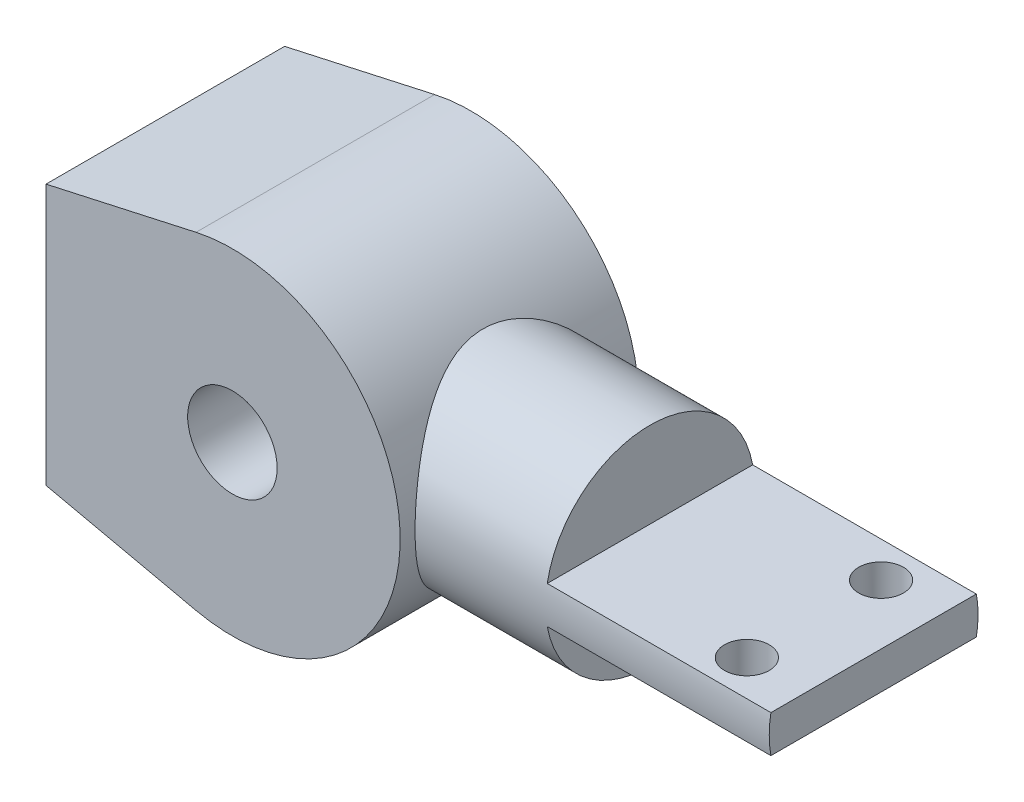
ISO-10303-21;
HEADER;
FILE_DESCRIPTION(('STEP AP214'),'2;1');
FILE_NAME('part.step','',(''),(''),'','','');
FILE_SCHEMA(('AUTOMOTIVE_DESIGN { 1 0 10303 214 1 1 1 1 }'));
ENDSEC;
DATA;
#1=APPLICATION_CONTEXT('core data for automotive mechanical design processes');
#2=APPLICATION_PROTOCOL_DEFINITION('international standard','automotive_design',2000,#1);
#3=PRODUCT_CONTEXT('',#1,'mechanical');
#4=PRODUCT('Part','Part','',(#3));
#5=PRODUCT_RELATED_PRODUCT_CATEGORY('part','',(#4));
#6=PRODUCT_DEFINITION_FORMATION('','',#4);
#7=PRODUCT_DEFINITION_CONTEXT('part definition',#1,'design');
#8=PRODUCT_DEFINITION('design','',#6,#7);
#9=PRODUCT_DEFINITION_SHAPE('','',#8);
#10=(LENGTH_UNIT() NAMED_UNIT(*) SI_UNIT(.MILLI.,.METRE.));
#11=(NAMED_UNIT(*) PLANE_ANGLE_UNIT() SI_UNIT($,.RADIAN.));
#12=(NAMED_UNIT(*) SI_UNIT($,.STERADIAN.) SOLID_ANGLE_UNIT());
#13=UNCERTAINTY_MEASURE_WITH_UNIT(LENGTH_MEASURE(1.E-05),#10,'distance_accuracy_value','');
#14=(GEOMETRIC_REPRESENTATION_CONTEXT(3) GLOBAL_UNCERTAINTY_ASSIGNED_CONTEXT((#13)) GLOBAL_UNIT_ASSIGNED_CONTEXT((#10,
#11,#12)) REPRESENTATION_CONTEXT('',''));
#15=CARTESIAN_POINT('',(0.,0.,0.));
#16=DIRECTION('',(0.,0.,1.));
#17=DIRECTION('',(1.,0.,0.));
#18=AXIS2_PLACEMENT_3D('',#15,#16,#17);
#19=CARTESIAN_POINT('',(40.,0.,0.));
#20=DIRECTION('',(1.,0.,0.));
#21=DIRECTION('',(0.,0.,-1.));
#22=AXIS2_PLACEMENT_3D('',#19,#20,#21);
#23=PLANE('',#22);
#24=CARTESIAN_POINT('',(40.,0.,0.));
#25=DIRECTION('',(1.,0.,0.));
#26=DIRECTION('',(0.,0.,-1.));
#27=AXIS2_PLACEMENT_3D('',#24,#25,#26);
#28=CIRCLE('',#27,14.);
#29=CARTESIAN_POINT('',(40.,2.5,-13.7749773139559));
#30=VERTEX_POINT('',#29);
#31=CARTESIAN_POINT('',(40.,2.5,13.7749773139559));
#32=VERTEX_POINT('',#31);
#33=EDGE_CURVE('E59',#30,#32,#28,.T.);
#34=ORIENTED_EDGE('',*,*,#33,.T.);
#35=DIRECTION('',(0.,0.,-1.));
#36=VECTOR('',#35,1.);
#37=CARTESIAN_POINT('',(40.,2.5,0.));
#38=LINE('',#37,#36);
#39=EDGE_CURVE('E109',#32,#30,#38,.T.);
#40=ORIENTED_EDGE('',*,*,#39,.T.);
#41=EDGE_LOOP('',(#34,#40));
#42=FACE_BOUND('',#41,.T.);
#43=ADVANCED_FACE('F36',(#42),#23,.T.);
#44=CARTESIAN_POINT('',(0.,0.,16.));
#45=DIRECTION('',(0.,0.,1.));
#46=DIRECTION('',(1.,0.,0.));
#47=AXIS2_PLACEMENT_3D('',#44,#45,#46);
#48=PLANE('',#47);
#49=DIRECTION('',(-0.976255788673511,-0.216620947928542,0.));
#50=VECTOR('',#49,1.);
#51=CARTESIAN_POINT('',(-4.87397132839219,21.965755245154,16.));
#52=LINE('',#51,#50);
#53=CARTESIAN_POINT('',(-4.87397132839219,21.965755245154,16.));
#54=VERTEX_POINT('',#53);
#55=CARTESIAN_POINT('',(-25.,17.5,16.));
#56=VERTEX_POINT('',#55);
#57=EDGE_CURVE('E199',#54,#56,#52,.T.);
#58=ORIENTED_EDGE('',*,*,#57,.T.);
#59=DIRECTION('',(0.,-1.,0.));
#60=VECTOR('',#59,1.);
#61=CARTESIAN_POINT('',(-25.,17.5,16.));
#62=LINE('',#61,#60);
#63=CARTESIAN_POINT('',(-25.,-17.5,16.));
#64=VERTEX_POINT('',#63);
#65=EDGE_CURVE('E211',#56,#64,#62,.T.);
#66=ORIENTED_EDGE('',*,*,#65,.T.);
#67=DIRECTION('',(0.976255788673511,-0.216620947928542,0.));
#68=VECTOR('',#67,1.);
#69=CARTESIAN_POINT('',(-4.87397132839219,-21.965755245154,16.));
#70=LINE('',#69,#68);
#71=CARTESIAN_POINT('',(-4.87397132839219,-21.965755245154,16.));
#72=VERTEX_POINT('',#71);
#73=EDGE_CURVE('E209',#64,#72,#70,.T.);
#74=ORIENTED_EDGE('',*,*,#73,.T.);
#75=CARTESIAN_POINT('',(0.,0.,16.));
#76=DIRECTION('',(0.,0.,1.));
#77=DIRECTION('',(1.,0.,0.));
#78=AXIS2_PLACEMENT_3D('',#75,#76,#77);
#79=CIRCLE('',#78,22.5);
#80=EDGE_CURVE('E196',#72,#54,#79,.T.);
#81=ORIENTED_EDGE('',*,*,#80,.T.);
#82=EDGE_LOOP('',(#58,#66,#74,#81));
#83=FACE_BOUND('',#82,.T.);
#84=CARTESIAN_POINT('',(0.,0.,16.));
#85=DIRECTION('',(0.,0.,1.));
#86=DIRECTION('',(1.,0.,0.));
#87=AXIS2_PLACEMENT_3D('',#84,#85,#86);
#88=CIRCLE('',#87,6.);
#89=CARTESIAN_POINT('',(6.,0.,16.));
#90=VERTEX_POINT('',#89);
#91=EDGE_CURVE('E207',#90,#90,#88,.T.);
#92=ORIENTED_EDGE('',*,*,#91,.F.);
#93=EDGE_LOOP('',(#92));
#94=FACE_BOUND('',#93,.T.);
#95=ADVANCED_FACE('F166',(#83,#94),#48,.T.);
#96=CARTESIAN_POINT('',(0.,0.,-16.));
#97=DIRECTION('',(0.,0.,1.));
#98=DIRECTION('',(1.,0.,0.));
#99=AXIS2_PLACEMENT_3D('',#96,#97,#98);
#100=PLANE('',#99);
#101=DIRECTION('',(-0.976255788673511,-0.216620947928542,0.));
#102=VECTOR('',#101,1.);
#103=CARTESIAN_POINT('',(-4.87397132839219,21.965755245154,-16.));
#104=LINE('',#103,#102);
#105=CARTESIAN_POINT('',(-4.87397132839219,21.965755245154,-16.));
#106=VERTEX_POINT('',#105);
#107=CARTESIAN_POINT('',(-25.,17.5,-16.));
#108=VERTEX_POINT('',#107);
#109=EDGE_CURVE('E204',#106,#108,#104,.T.);
#110=ORIENTED_EDGE('',*,*,#109,.F.);
#111=CARTESIAN_POINT('',(0.,0.,-16.));
#112=DIRECTION('',(0.,0.,1.));
#113=DIRECTION('',(1.,0.,0.));
#114=AXIS2_PLACEMENT_3D('',#111,#112,#113);
#115=CIRCLE('',#114,22.5);
#116=CARTESIAN_POINT('',(-4.87397132839219,-21.965755245154,-16.));
#117=VERTEX_POINT('',#116);
#118=EDGE_CURVE('E197',#117,#106,#115,.T.);
#119=ORIENTED_EDGE('',*,*,#118,.F.);
#120=DIRECTION('',(0.976255788673511,-0.216620947928542,0.));
#121=VECTOR('',#120,1.);
#122=CARTESIAN_POINT('',(-4.87397132839219,-21.965755245154,-16.));
#123=LINE('',#122,#121);
#124=CARTESIAN_POINT('',(-25.,-17.5,-16.));
#125=VERTEX_POINT('',#124);
#126=EDGE_CURVE('E200',#125,#117,#123,.T.);
#127=ORIENTED_EDGE('',*,*,#126,.F.);
#128=DIRECTION('',(0.,-1.,0.));
#129=VECTOR('',#128,1.);
#130=CARTESIAN_POINT('',(-25.,17.5,-16.));
#131=LINE('',#130,#129);
#132=EDGE_CURVE('E202',#108,#125,#131,.T.);
#133=ORIENTED_EDGE('',*,*,#132,.F.);
#134=EDGE_LOOP('',(#110,#119,#127,#133));
#135=FACE_BOUND('',#134,.T.);
#136=CARTESIAN_POINT('',(0.,0.,-16.));
#137=DIRECTION('',(0.,0.,1.));
#138=DIRECTION('',(1.,0.,0.));
#139=AXIS2_PLACEMENT_3D('',#136,#137,#138);
#140=CIRCLE('',#139,6.);
#141=CARTESIAN_POINT('',(6.,0.,-16.));
#142=VERTEX_POINT('',#141);
#143=EDGE_CURVE('E215',#142,#142,#140,.T.);
#144=ORIENTED_EDGE('',*,*,#143,.T.);
#145=EDGE_LOOP('',(#144));
#146=FACE_BOUND('',#145,.T.);
#147=ADVANCED_FACE('F222',(#135,#146),#100,.F.);
#148=CARTESIAN_POINT('',(-4.87397132839219,21.965755245154,16.));
#149=DIRECTION('',(0.216620947928542,-0.976255788673511,0.));
#150=DIRECTION('',(0.976255788673512,0.216620947928542,0.));
#151=AXIS2_PLACEMENT_3D('',#148,#149,#150);
#152=PLANE('',#151);
#153=ORIENTED_EDGE('',*,*,#109,.T.);
#154=DIRECTION('',(0.,0.,-1.));
#155=VECTOR('',#154,1.);
#156=CARTESIAN_POINT('',(-25.,17.5,16.));
#157=LINE('',#156,#155);
#158=EDGE_CURVE('E11',#56,#108,#157,.T.);
#159=ORIENTED_EDGE('',*,*,#158,.F.);
#160=ORIENTED_EDGE('',*,*,#57,.F.);
#161=DIRECTION('',(0.,0.,-1.));
#162=VECTOR('',#161,1.);
#163=CARTESIAN_POINT('',(-4.87397132839219,21.965755245154,16.));
#164=LINE('',#163,#162);
#165=EDGE_CURVE('E193',#54,#106,#164,.T.);
#166=ORIENTED_EDGE('',*,*,#165,.T.);
#167=EDGE_LOOP('',(#153,#159,#160,#166));
#168=FACE_BOUND('',#167,.T.);
#169=ADVANCED_FACE('F38',(#168),#152,.F.);
#170=CARTESIAN_POINT('',(-25.,17.5,16.));
#171=DIRECTION('',(1.,0.,0.));
#172=DIRECTION('',(0.,0.,-1.));
#173=AXIS2_PLACEMENT_3D('',#170,#171,#172);
#174=PLANE('',#173);
#175=ORIENTED_EDGE('',*,*,#132,.T.);
#176=DIRECTION('',(0.,0.,-1.));
#177=VECTOR('',#176,1.);
#178=CARTESIAN_POINT('',(-25.,-17.5,16.));
#179=LINE('',#178,#177);
#180=EDGE_CURVE('E45',#64,#125,#179,.T.);
#181=ORIENTED_EDGE('',*,*,#180,.F.);
#182=ORIENTED_EDGE('',*,*,#65,.F.);
#183=ORIENTED_EDGE('',*,*,#158,.T.);
#184=EDGE_LOOP('',(#175,#181,#182,#183));
#185=FACE_BOUND('',#184,.T.);
#186=ADVANCED_FACE('F236',(#185),#174,.F.);
#187=CARTESIAN_POINT('',(-4.87397132839219,-21.965755245154,16.));
#188=DIRECTION('',(0.216620947928542,0.976255788673511,0.));
#189=DIRECTION('',(-0.976255788673512,0.216620947928542,0.));
#190=AXIS2_PLACEMENT_3D('',#187,#188,#189);
#191=PLANE('',#190);
#192=ORIENTED_EDGE('',*,*,#126,.T.);
#193=DIRECTION('',(0.,0.,-1.));
#194=VECTOR('',#193,1.);
#195=CARTESIAN_POINT('',(-4.87397132839219,-21.965755245154,16.));
#196=LINE('',#195,#194);
#197=EDGE_CURVE('E190',#72,#117,#196,.T.);
#198=ORIENTED_EDGE('',*,*,#197,.F.);
#199=ORIENTED_EDGE('',*,*,#73,.F.);
#200=ORIENTED_EDGE('',*,*,#180,.T.);
#201=EDGE_LOOP('',(#192,#198,#199,#200));
#202=FACE_BOUND('',#201,.T.);
#203=ADVANCED_FACE('F233',(#202),#191,.F.);
#204=CARTESIAN_POINT('',(0.,0.,16.));
#205=DIRECTION('',(0.,0.,-1.));
#206=DIRECTION('',(-1.,0.,0.));
#207=AXIS2_PLACEMENT_3D('',#204,#205,#206);
#208=CYLINDRICAL_SURFACE('',#207,22.5);
#209=CARTESIAN_POINT('',(22.5,0.,-14.));
#210=CARTESIAN_POINT('',(22.4999990143699,0.356097070760692,-13.9999991063449));
#211=CARTESIAN_POINT('',(22.4915272958149,0.712218350277574,-13.9863954765435));
#212=CARTESIAN_POINT('',(22.4578466611244,1.42174063001493,-13.9321685824194));
#213=CARTESIAN_POINT('',(22.4326301887648,1.77514032923202,-13.8915331197188));
#214=CARTESIAN_POINT('',(22.3660283513862,2.47694073666972,-13.7837231030717));
#215=CARTESIAN_POINT('',(22.3246150990087,2.82533174256533,-13.7165027734724));
#216=CARTESIAN_POINT('',(22.2266321618331,3.51394010054276,-13.5564441244614));
#217=CARTESIAN_POINT('',(22.1700640019058,3.85415827121584,-13.4636083824175));
#218=CARTESIAN_POINT('',(22.0433958764243,4.52259338441289,-13.2539894629711));
#219=CARTESIAN_POINT('',(21.9733648543906,4.85086174847135,-13.1373281147551));
#220=CARTESIAN_POINT('',(21.8211053520407,5.49536361825577,-12.8810427155204));
#221=CARTESIAN_POINT('',(21.7388766091287,5.81159686470234,-12.7414181701369));
#222=CARTESIAN_POINT('',(21.5639238631528,6.43044019166893,-12.4405700102356));
#223=CARTESIAN_POINT('',(21.4712031207009,6.73305446393551,-12.2793531031596));
#224=CARTESIAN_POINT('',(21.2770168328875,7.32360555209682,-11.9365571460911));
#225=CARTESIAN_POINT('',(21.1755502028841,7.61154054043849,-11.7549755696832));
#226=CARTESIAN_POINT('',(20.9573974599138,8.19400545558421,-11.3574765199916));
#227=CARTESIAN_POINT('',(20.8401426208988,8.48724295592486,-11.1399774171205));
#228=CARTESIAN_POINT('',(20.600024873324,9.05449350465571,-10.6840341744649));
#229=CARTESIAN_POINT('',(20.4771617165154,9.32850570068461,-10.445589107087));
#230=CARTESIAN_POINT('',(20.2281690739126,9.85680235955471,-9.94862465188904));
#231=CARTESIAN_POINT('',(20.1020356451637,10.111061375416,-9.69008020116803));
#232=CARTESIAN_POINT('',(19.8492724340888,10.5986702200811,-9.1542032090265));
#233=CARTESIAN_POINT('',(19.722642637357,10.8320194372713,-8.87687011845291));
#234=CARTESIAN_POINT('',(19.4547996495074,11.3068419436011,-8.2658596247561));
#235=CARTESIAN_POINT('',(19.3139089577244,11.545205662179,-7.92961458355073));
#236=CARTESIAN_POINT('',(19.0393482416016,11.9925865501106,-7.23522428056693));
#237=CARTESIAN_POINT('',(18.9056795541224,12.2015982975125,-6.877074990088));
#238=CARTESIAN_POINT('',(18.6504569420656,12.5882506642244,-6.14073545483857));
#239=CARTESIAN_POINT('',(18.528886831374,12.7659334496767,-5.76257305179082));
#240=CARTESIAN_POINT('',(18.3026958276451,13.0881671689531,-4.98756561364782));
#241=CARTESIAN_POINT('',(18.1980680018518,13.2327316648236,-4.59072830652404));
#242=CARTESIAN_POINT('',(18.0349292211783,13.4538110619401,-3.88513918827319));
#243=CARTESIAN_POINT('',(17.9714792470539,13.5382643592609,-3.57999709901742));
#244=CARTESIAN_POINT('',(17.8586883245612,13.6867074831745,-2.96224320580907));
#245=CARTESIAN_POINT('',(17.8093439846518,13.7507022292345,-2.64963321704918));
#246=CARTESIAN_POINT('',(17.7265086605148,13.8573251676281,-2.01907360660311));
#247=CARTESIAN_POINT('',(17.6929994513684,13.8999779261594,-1.70113056156642));
#248=CARTESIAN_POINT('',(17.6430064881633,13.9633794501665,-1.06171502205683));
#249=CARTESIAN_POINT('',(17.6265229749471,13.9841279057882,-0.740242477721284));
#250=CARTESIAN_POINT('',(17.6112162512838,14.0034002854199,-0.0953808872242191));
#251=CARTESIAN_POINT('',(17.6124383808281,14.0018671514822,0.228010958708225));
#252=CARTESIAN_POINT('',(17.6326039054413,13.97646364726,0.873354428547934));
#253=CARTESIAN_POINT('',(17.6515473921147,13.9525931615104,1.19530604500179));
#254=CARTESIAN_POINT('',(17.7064243703099,13.8828847906998,1.83556301177622));
#255=CARTESIAN_POINT('',(17.7423695341295,13.8370318135284,2.15386570296615));
#256=CARTESIAN_POINT('',(17.8299101531281,13.7240443241488,2.78446216526763));
#257=CARTESIAN_POINT('',(17.8815059542076,13.6569093415775,3.09675580340859));
#258=CARTESIAN_POINT('',(17.9972888935506,13.5039464211317,3.70676991729286));
#259=CARTESIAN_POINT('',(18.0611741417939,13.4185620879421,4.00465984733719));
#260=CARTESIAN_POINT('',(18.2003635920619,13.2291560354186,4.59179982140109));
#261=CARTESIAN_POINT('',(18.2756715114669,13.1251282467728,4.88104701592401));
#262=CARTESIAN_POINT('',(18.4357306593898,12.8993400599701,5.44983142456797));
#263=CARTESIAN_POINT('',(18.5204822849188,12.7775789162412,5.7293682298181));
#264=CARTESIAN_POINT('',(18.6974771275311,12.517153681204,6.27798380238451));
#265=CARTESIAN_POINT('',(18.7897207095436,12.3784887663568,6.54706205932532));
#266=CARTESIAN_POINT('',(18.997481055651,12.0577227084505,7.12315036574905));
#267=CARTESIAN_POINT('',(19.114138485546,11.8723373870692,7.42792424344295));
#268=CARTESIAN_POINT('',(19.3523613239283,11.4799300062105,8.02107596986107));
#269=CARTESIAN_POINT('',(19.4739260475583,11.2729109595519,8.30945609304614));
#270=CARTESIAN_POINT('',(19.7193557781036,10.8378705685859,8.86940709190691));
#271=CARTESIAN_POINT('',(19.8432230246409,10.6098278185812,9.14096035407191));
#272=CARTESIAN_POINT('',(20.0905456910712,10.1337040929321,9.6661096951861));
#273=CARTESIAN_POINT('',(20.2140010842358,9.88562184213812,9.9197046294846));
#274=CARTESIAN_POINT('',(20.4778479284996,9.3283197696847,10.4476162402387));
#275=CARTESIAN_POINT('',(20.6177380925806,9.01571048102724,10.7186212696107));
#276=CARTESIAN_POINT('',(20.8899601598757,8.36562967979878,11.2333493529561));
#277=CARTESIAN_POINT('',(21.0222911743807,8.02815525453593,11.4770692023033));
#278=CARTESIAN_POINT('',(21.2758074096154,7.3299323932841,11.9350888320568));
#279=CARTESIAN_POINT('',(21.3969953836647,6.96918974429674,12.1493958865148));
#280=CARTESIAN_POINT('',(21.6248469618756,6.22630498724363,12.5463308451294));
#281=CARTESIAN_POINT('',(21.7315123020849,5.84416544470126,12.7289625365012));
#282=CARTESIAN_POINT('',(21.9217363589385,5.08260793859718,13.0509942907445));
#283=CARTESIAN_POINT('',(22.0062449689521,4.70420212464339,13.1922230753291));
#284=CARTESIAN_POINT('',(22.1570252528652,3.93324908027808,13.442236496525));
#285=CARTESIAN_POINT('',(22.2232972892521,3.54070213112461,13.5510217780177));
#286=CARTESIAN_POINT('',(22.3354988912287,2.74528889528994,13.7342547837559));
#287=CARTESIAN_POINT('',(22.3814519255366,2.34243508535216,13.8087421267131));
#288=CARTESIAN_POINT('',(22.4516271114232,1.52990582154782,13.9221968391314));
#289=CARTESIAN_POINT('',(22.4758528968536,1.12023152007733,13.961170148282));
#290=CARTESIAN_POINT('',(22.4998719272296,0.358889373676654,13.9997998195308));
#291=CARTESIAN_POINT('',(22.5027361711104,0.00755774378719221,14.0043982827077));
#292=CARTESIAN_POINT('',(22.4920251896601,-0.694179982355568,13.9871816996814));
#293=CARTESIAN_POINT('',(22.4784519037889,-1.04458618291156,13.9653697696335));
#294=CARTESIAN_POINT('',(22.4352021344506,-1.74175208722438,13.8956481416465));
#295=CARTESIAN_POINT('',(22.4055265956152,-2.08851200367258,13.8477399746312));
#296=CARTESIAN_POINT('',(22.3307880770863,-2.77586354777609,13.7264844114638));
#297=CARTESIAN_POINT('',(22.285724811575,-3.11645506073326,13.653136542784));
#298=CARTESIAN_POINT('',(22.1832184234865,-3.77653035917098,13.4851559526508));
#299=CARTESIAN_POINT('',(22.1263027830684,-4.09632676495062,13.3914243330754));
#300=CARTESIAN_POINT('',(22.0003545406357,-4.72626431908141,13.1822823440839));
#301=CARTESIAN_POINT('',(21.931322429587,-5.0364058580537,13.0668728530538));
#302=CARTESIAN_POINT('',(21.782472736762,-5.64554678099418,12.8154741779394));
#303=CARTESIAN_POINT('',(21.7026548278234,-5.94454582662948,12.6794843695837));
#304=CARTESIAN_POINT('',(21.5336854587996,-6.5301837746921,12.3880468486983));
#305=CARTESIAN_POINT('',(21.4445328551239,-6.81682115660849,12.2325967516374));
#306=CARTESIAN_POINT('',(21.2490077061142,-7.40508045510371,11.8866610539475));
#307=CARTESIAN_POINT('',(21.1418056549229,-7.70527800990255,11.6942214627053));
#308=CARTESIAN_POINT('',(20.9200990227065,-8.28835118714579,11.288463870177));
#309=CARTESIAN_POINT('',(20.8055940342632,-8.57122584144697,11.0751447036999));
#310=CARTESIAN_POINT('',(20.5713838782847,-9.11904546917578,10.628640705419));
#311=CARTESIAN_POINT('',(20.4516736642968,-9.38397237592854,10.3954363746239));
#312=CARTESIAN_POINT('',(20.2094563165926,-9.89483745973913,9.91041232281628));
#313=CARTESIAN_POINT('',(20.0869489675645,-10.1407741685819,9.65859116539602));
#314=CARTESIAN_POINT('',(19.8238941960109,-10.646867649964,9.09978037256264));
#315=CARTESIAN_POINT('',(19.6832841834239,-10.9039892311197,8.79006308548143));
#316=CARTESIAN_POINT('',(19.4053328807151,-11.3913021109329,8.14864949782422));
#317=CARTESIAN_POINT('',(19.2679921450446,-11.621488867149,7.81694950469237));
#318=CARTESIAN_POINT('',(19.0008081273582,-12.0533696487139,7.13300281471241));
#319=CARTESIAN_POINT('',(18.8709590653482,-12.25508581837,6.78077239104192));
#320=CARTESIAN_POINT('',(18.623036461906,-12.6286498218822,6.05666117524255));
#321=CARTESIAN_POINT('',(18.5049651721,-12.8004919491879,5.68477664643217));
#322=CARTESIAN_POINT('',(18.308524713068,-13.0793953783023,5.0034855779446));
#323=CARTESIAN_POINT('',(18.2270330766376,-13.1924763545354,4.69743443018148));
#324=CARTESIAN_POINT('',(18.076746941565,-13.3976638555018,4.07550371447287));
#325=CARTESIAN_POINT('',(18.0079448101369,-13.489782996707,3.75963018923896));
#326=CARTESIAN_POINT('',(17.8853144274028,-13.6519549960383,3.11976359885008));
#327=CARTESIAN_POINT('',(17.8314700867102,-13.7220315751265,2.79577966995472));
#328=CARTESIAN_POINT('',(17.7406403655119,-13.8392629880396,2.14132899837133));
#329=CARTESIAN_POINT('',(17.7036549489399,-13.8864178709009,1.8108622695535));
#330=CARTESIAN_POINT('',(17.6478825891211,-13.9572312071607,1.14399970642003));
#331=CARTESIAN_POINT('',(17.6291980840485,-13.9807574190091,0.807581108722389));
#332=CARTESIAN_POINT('',(17.6111969753959,-14.0034266162649,0.133399167373299));
#333=CARTESIAN_POINT('',(17.6118803050355,-14.0025696857454,-0.204364171637467));
#334=CARTESIAN_POINT('',(17.6325872637024,-13.9764850836819,-0.878453554406331));
#335=CARTESIAN_POINT('',(17.6526172788984,-13.9512493649163,-1.21477908673595));
#336=CARTESIAN_POINT('',(17.7111635018145,-13.8768481077348,-1.88312198541007));
#337=CARTESIAN_POINT('',(17.749679494092,-13.8276828482026,-2.21513940191667));
#338=CARTESIAN_POINT('',(17.840004620949,-13.7109159899639,-2.84709643093499));
#339=CARTESIAN_POINT('',(17.8905606177838,-13.6450271196387,-3.14753630822844));
#340=CARTESIAN_POINT('',(18.0044960451393,-13.4943337274358,-3.74122938906233));
#341=CARTESIAN_POINT('',(18.0678795853599,-13.4095231425079,-4.03448025553805));
#342=CARTESIAN_POINT('',(18.2056705838513,-13.221841038016,-4.61251008112275));
#343=CARTESIAN_POINT('',(18.2800790946627,-13.1189677938579,-4.89728822823095));
#344=CARTESIAN_POINT('',(18.4380147760727,-12.8960582969548,-5.45734443068171));
#345=CARTESIAN_POINT('',(18.5215422903159,-12.7760213973541,-5.73262212749024));
#346=CARTESIAN_POINT('',(18.8085087023368,-12.3537800104942,-6.62221127308822));
#347=CARTESIAN_POINT('',(19.0275484110721,-12.0164484645334,-7.21544987836899));
#348=CARTESIAN_POINT('',(19.3687576085944,-11.4520694849974,-8.06010022417248));
#349=CARTESIAN_POINT('',(19.4846859677146,-11.2540573187376,-8.33428789874449));
#350=CARTESIAN_POINT('',(19.7185274416532,-10.8391103665342,-8.86722196562069));
#351=CARTESIAN_POINT('',(19.8364406997267,-10.6221742100325,-9.12596723722914));
#352=CARTESIAN_POINT('',(20.0948793656167,-10.1261301722912,-9.67595262090818));
#353=CARTESIAN_POINT('',(20.2353422163846,-9.8431365748014,-9.96372478000989));
#354=CARTESIAN_POINT('',(20.5122398874249,-9.25227001166964,-10.514689399335));
#355=CARTESIAN_POINT('',(20.6486741855883,-8.94439384034817,-10.777878683044));
#356=CARTESIAN_POINT('',(20.9141680993678,-8.30466819647365,-11.278183042151));
#357=CARTESIAN_POINT('',(21.0432226332422,-7.97280255237931,-11.5152802518571));
#358=CARTESIAN_POINT('',(21.2286445071225,-7.45841218343328,-11.8496380531149));
#359=CARTESIAN_POINT('',(21.2890912173789,-7.28418533088142,-11.9575416277361));
#360=CARTESIAN_POINT('',(21.4069042672453,-6.93031323868879,-12.1660574077229));
#361=CARTESIAN_POINT('',(21.4642694527674,-6.75066600781436,-12.2666668861796));
#362=CARTESIAN_POINT('',(21.6308630806129,-6.20485018192081,-12.5566431024792));
#363=CARTESIAN_POINT('',(21.734893555375,-5.83097261813778,-12.7347014185717));
#364=CARTESIAN_POINT('',(21.9259968322529,-5.06520334425361,-13.0581919714671));
#365=CARTESIAN_POINT('',(22.0130726600171,-4.67331486375517,-13.2036300302365));
#366=CARTESIAN_POINT('',(22.1288541727767,-4.07492554203533,-13.3954748988431));
#367=CARTESIAN_POINT('',(22.1649399126865,-3.87396203641954,-13.4549795158029));
#368=CARTESIAN_POINT('',(22.2319460011667,-3.46882497824043,-13.5650774576718));
#369=CARTESIAN_POINT('',(22.2628676920629,-3.26465227501013,-13.6156730985371));
#370=CARTESIAN_POINT('',(22.3474561898602,-2.64818147624365,-13.7536968188771));
#371=CARTESIAN_POINT('',(22.3930199664094,-2.23155423681449,-13.8274827573131));
#372=CARTESIAN_POINT('',(22.4511563186984,-1.51200587963174,-13.9213973375204));
#373=CARTESIAN_POINT('',(22.4694403922936,-1.21069651376639,-13.9508414460303));
#374=CARTESIAN_POINT('',(22.493863027433,-0.60626402043172,-13.9901437623131));
#375=CARTESIAN_POINT('',(22.500000839054,-0.303140782130808,-14.0000007607569));
#376=CARTESIAN_POINT('',(22.5,0.,-14.));
#377=B_SPLINE_CURVE_WITH_KNOTS('',3,(#209,#210,#211,#212,#213,#214,#215,#216,#217,#218,#219,
#220,#221,#222,#223,#224,#225,#226,#227,#228,#229,#230,#231,#232,#233,#234,#235,#236,#237,#238,
#239,#240,#241,#242,#243,#244,#245,#246,#247,#248,#249,#250,#251,#252,#253,#254,#255,#256,#257,
#258,#259,#260,#261,#262,#263,#264,#265,#266,#267,#268,#269,#270,#271,#272,#273,#274,#275,#276,
#277,#278,#279,#280,#281,#282,#283,#284,#285,#286,#287,#288,#289,#290,#291,#292,#293,#294,#295,
#296,#297,#298,#299,#300,#301,#302,#303,#304,#305,#306,#307,#308,#309,#310,#311,#312,#313,#314,
#315,#316,#317,#318,#319,#320,#321,#322,#323,#324,#325,#326,#327,#328,#329,#330,#331,#332,#333,
#334,#335,#336,#337,#338,#339,#340,#341,#342,#343,#344,#345,#346,#347,#348,#349,#350,#351,#352,
#353,#354,#355,#356,#357,#358,#359,#360,#361,#362,#363,#364,#365,#366,#367,#368,#369,#370,#371,
#372,#373,#374,#375,#376),.UNSPECIFIED.,.T.,.F.,(4,2,2,2,2,2,2,2,2,2,2,2,2,2,2,2,2,2,2,2,2,2,2,
2,2,2,2,2,2,2,2,2,2,2,2,2,2,2,2,2,2,2,2,2,2,2,2,2,2,2,2,2,2,2,2,2,2,2,2,2,2,2,2,2,2,2,2,2,2,2,2,
2,2,2,2,2,2,2,2,2,2,2,2,4),(0.,1.0679758240011,2.13643390971612,3.20673980634869,
4.27693805034709,5.34179515043565,6.40667517837593,7.47122517637423,8.53590738751166,
9.68514764063391,10.8344388136121,11.9851868179432,13.1359684707804,14.4411277016062,
15.7465277076779,17.050157116286,18.3532517263712,19.3210355800973,20.2885865449823,
21.2550212106111,22.2214695470601,23.1903931671192,24.1593217957176,25.1289165983471,
26.0985328319181,27.0468234955661,27.9954234345664,28.9440632675324,29.8927493359957,
31.0176229184045,32.1423400536389,33.2682152625584,34.3941621694695,35.7027545883913,
37.0115005397421,38.319922240839,39.6281873945368,40.8643030963197,42.1003942261178,
43.3350539008242,44.5695070419136,45.6222879649376,46.6749446827224,47.7275396535305,
48.7801541767215,49.7933045186598,50.8064138166712,51.8195538519125,52.8328181521628,
53.9487475505037,55.0647392591575,56.1818381561973,57.299023334728,58.576749957317,
59.8546917533393,61.1316340282376,62.4088199577247,63.4167689572915,64.4241096801529,
65.4303626213413,66.4366134098462,67.4484649713284,68.4603130439499,69.4724952328049,
70.4846656255925,71.4188354910979,72.3533051219357,73.2878640230142,74.222458154589,
76.3635260888551,77.4355285185538,78.5076086519192,79.7882052430145,81.0689670801281,
82.3506004909615,82.9914037086745,83.6324452693032,84.9114151721034,86.1901566261962,
86.8279270975521,87.465531530065,88.7395392601873,89.648636993739,90.55779085421),.UNSPECIFIED.);
#378=CARTESIAN_POINT('',(22.5,0.,-14.));
#379=VERTEX_POINT('',#378);
#380=EDGE_CURVE('E111',#379,#379,#377,.T.);
#381=ORIENTED_EDGE('',*,*,#380,.F.);
#382=EDGE_LOOP('',(#381));
#383=FACE_BOUND('',#382,.T.);
#384=ORIENTED_EDGE('',*,*,#118,.T.);
#385=ORIENTED_EDGE('',*,*,#165,.F.);
#386=ORIENTED_EDGE('',*,*,#80,.F.);
#387=ORIENTED_EDGE('',*,*,#197,.T.);
#388=EDGE_LOOP('',(#384,#385,#386,#387));
#389=FACE_BOUND('',#388,.T.);
#390=ADVANCED_FACE('F163',(#383,#389),#208,.T.);
#391=CARTESIAN_POINT('',(0.,0.,16.));
#392=DIRECTION('',(0.,0.,-1.));
#393=DIRECTION('',(-1.,0.,0.));
#394=AXIS2_PLACEMENT_3D('',#391,#392,#393);
#395=CYLINDRICAL_SURFACE('',#394,6.);
#396=ORIENTED_EDGE('',*,*,#91,.T.);
#397=EDGE_LOOP('',(#396));
#398=FACE_BOUND('',#397,.T.);
#399=ORIENTED_EDGE('',*,*,#143,.F.);
#400=EDGE_LOOP('',(#399));
#401=FACE_BOUND('',#400,.T.);
#402=ADVANCED_FACE('F158',(#398,#401),#395,.F.);
#403=DIRECTION('',(0.,0.,-1.));
#404=VECTOR('',#403,1.);
#405=CARTESIAN_POINT('',(40.,-2.5,0.));
#406=LINE('',#405,#404);
#407=CARTESIAN_POINT('',(40.,-2.5,13.7749773139559));
#408=VERTEX_POINT('',#407);
#409=CARTESIAN_POINT('',(40.,-2.5,-13.7749773139559));
#410=VERTEX_POINT('',#409);
#411=EDGE_CURVE('E52',#408,#410,#406,.T.);
#412=ORIENTED_EDGE('',*,*,#411,.F.);
#413=EDGE_CURVE('E148',#408,#410,#28,.T.);
#414=ORIENTED_EDGE('',*,*,#413,.T.);
#415=EDGE_LOOP('',(#412,#414));
#416=FACE_BOUND('',#415,.T.);
#417=ADVANCED_FACE('F156',(#416),#23,.T.);
#418=CARTESIAN_POINT('',(-25.002,0.,0.));
#419=DIRECTION('',(1.,0.,0.));
#420=DIRECTION('',(0.,0.,-1.));
#421=AXIS2_PLACEMENT_3D('',#418,#419,#420);
#422=CYLINDRICAL_SURFACE('',#421,14.);
#423=ORIENTED_EDGE('',*,*,#33,.F.);
#424=DIRECTION('',(-1.,0.,0.));
#425=VECTOR('',#424,1.);
#426=CARTESIAN_POINT('',(70.,2.5,-13.7749773139559));
#427=LINE('',#426,#425);
#428=CARTESIAN_POINT('',(70.,2.5,-13.7749773139559));
#429=VERTEX_POINT('',#428);
#430=EDGE_CURVE('E135',#429,#30,#427,.T.);
#431=ORIENTED_EDGE('',*,*,#430,.F.);
#432=CARTESIAN_POINT('',(70.,0.,0.));
#433=DIRECTION('',(1.,0.,0.));
#434=DIRECTION('',(0.,0.,-1.));
#435=AXIS2_PLACEMENT_3D('',#432,#433,#434);
#436=CIRCLE('',#435,14.);
#437=CARTESIAN_POINT('',(70.,-2.5,-13.7749773139559));
#438=VERTEX_POINT('',#437);
#439=EDGE_CURVE('E123',#438,#429,#436,.T.);
#440=ORIENTED_EDGE('',*,*,#439,.F.);
#441=DIRECTION('',(-1.,0.,0.));
#442=VECTOR('',#441,1.);
#443=CARTESIAN_POINT('',(70.,-2.5,-13.7749773139559));
#444=LINE('',#443,#442);
#445=EDGE_CURVE('E137',#438,#410,#444,.T.);
#446=ORIENTED_EDGE('',*,*,#445,.T.);
#447=ORIENTED_EDGE('',*,*,#413,.F.);
#448=DIRECTION('',(-1.,0.,0.));
#449=VECTOR('',#448,1.);
#450=CARTESIAN_POINT('',(70.,-2.5,13.7749773139559));
#451=LINE('',#450,#449);
#452=CARTESIAN_POINT('',(70.,-2.5,13.7749773139559));
#453=VERTEX_POINT('',#452);
#454=EDGE_CURVE('E112',#453,#408,#451,.T.);
#455=ORIENTED_EDGE('',*,*,#454,.F.);
#456=CARTESIAN_POINT('',(70.,2.5,13.7749773139559));
#457=VERTEX_POINT('',#456);
#458=EDGE_CURVE('E115',#457,#453,#436,.T.);
#459=ORIENTED_EDGE('',*,*,#458,.F.);
#460=DIRECTION('',(-1.,0.,0.));
#461=VECTOR('',#460,1.);
#462=CARTESIAN_POINT('',(70.,2.5,13.7749773139559));
#463=LINE('',#462,#461);
#464=EDGE_CURVE('E103',#457,#32,#463,.T.);
#465=ORIENTED_EDGE('',*,*,#464,.T.);
#466=EDGE_LOOP('',(#423,#431,#440,#446,#447,#455,#459,#465));
#467=FACE_BOUND('',#466,.T.);
#468=ORIENTED_EDGE('',*,*,#380,.T.);
#469=EDGE_LOOP('',(#468));
#470=FACE_BOUND('',#469,.T.);
#471=ADVANCED_FACE('F116',(#467,#470),#422,.T.);
#472=CARTESIAN_POINT('',(70.,2.5,0.));
#473=DIRECTION('',(0.,1.,0.));
#474=DIRECTION('',(0.,0.,1.));
#475=AXIS2_PLACEMENT_3D('',#472,#473,#474);
#476=PLANE('',#475);
#477=CARTESIAN_POINT('',(62.,2.5,9.));
#478=DIRECTION('',(0.,1.,0.));
#479=DIRECTION('',(0.,0.,1.));
#480=AXIS2_PLACEMENT_3D('',#477,#478,#479);
#481=CIRCLE('',#480,3.00000000000001);
#482=CARTESIAN_POINT('',(62.,2.5,12.));
#483=VERTEX_POINT('',#482);
#484=EDGE_CURVE('E177',#483,#483,#481,.T.);
#485=ORIENTED_EDGE('',*,*,#484,.F.);
#486=EDGE_LOOP('',(#485));
#487=FACE_BOUND('',#486,.T.);
#488=CARTESIAN_POINT('',(62.,2.5,-9.));
#489=DIRECTION('',(0.,1.,0.));
#490=DIRECTION('',(0.,0.,-1.));
#491=AXIS2_PLACEMENT_3D('',#488,#489,#490);
#492=CIRCLE('',#491,2.99999999999999);
#493=CARTESIAN_POINT('',(62.,2.5,-12.));
#494=VERTEX_POINT('',#493);
#495=EDGE_CURVE('E130',#494,#494,#492,.T.);
#496=ORIENTED_EDGE('',*,*,#495,.F.);
#497=EDGE_LOOP('',(#496));
#498=FACE_BOUND('',#497,.T.);
#499=ORIENTED_EDGE('',*,*,#39,.F.);
#500=ORIENTED_EDGE('',*,*,#464,.F.);
#501=DIRECTION('',(0.,0.,-1.));
#502=VECTOR('',#501,1.);
#503=CARTESIAN_POINT('',(70.,2.5,0.));
#504=LINE('',#503,#502);
#505=EDGE_CURVE('E108',#457,#429,#504,.T.);
#506=ORIENTED_EDGE('',*,*,#505,.T.);
#507=ORIENTED_EDGE('',*,*,#430,.T.);
#508=EDGE_LOOP('',(#499,#500,#506,#507));
#509=FACE_BOUND('',#508,.T.);
#510=ADVANCED_FACE('F105',(#487,#498,#509),#476,.T.);
#511=CARTESIAN_POINT('',(70.,-2.5,0.));
#512=DIRECTION('',(0.,1.,0.));
#513=DIRECTION('',(0.,0.,1.));
#514=AXIS2_PLACEMENT_3D('',#511,#512,#513);
#515=PLANE('',#514);
#516=CARTESIAN_POINT('',(62.,-2.5,9.));
#517=DIRECTION('',(0.,1.,0.));
#518=DIRECTION('',(0.,0.,1.));
#519=AXIS2_PLACEMENT_3D('',#516,#517,#518);
#520=CIRCLE('',#519,3.00000000000001);
#521=CARTESIAN_POINT('',(62.,-2.5,12.));
#522=VERTEX_POINT('',#521);
#523=EDGE_CURVE('E40',#522,#522,#520,.T.);
#524=ORIENTED_EDGE('',*,*,#523,.T.);
#525=EDGE_LOOP('',(#524));
#526=FACE_BOUND('',#525,.T.);
#527=CARTESIAN_POINT('',(62.,-2.5,-9.));
#528=DIRECTION('',(0.,1.,0.));
#529=DIRECTION('',(0.,0.,1.));
#530=AXIS2_PLACEMENT_3D('',#527,#528,#529);
#531=CIRCLE('',#530,2.99999999999999);
#532=CARTESIAN_POINT('',(62.,-2.5,-6.00000000000001));
#533=VERTEX_POINT('',#532);
#534=EDGE_CURVE('E181',#533,#533,#531,.T.);
#535=ORIENTED_EDGE('',*,*,#534,.T.);
#536=EDGE_LOOP('',(#535));
#537=FACE_BOUND('',#536,.T.);
#538=ORIENTED_EDGE('',*,*,#411,.T.);
#539=ORIENTED_EDGE('',*,*,#445,.F.);
#540=DIRECTION('',(0.,0.,-1.));
#541=VECTOR('',#540,1.);
#542=CARTESIAN_POINT('',(70.,-2.5,0.));
#543=LINE('',#542,#541);
#544=EDGE_CURVE('E121',#453,#438,#543,.T.);
#545=ORIENTED_EDGE('',*,*,#544,.F.);
#546=ORIENTED_EDGE('',*,*,#454,.T.);
#547=EDGE_LOOP('',(#538,#539,#545,#546));
#548=FACE_BOUND('',#547,.T.);
#549=ADVANCED_FACE('F168',(#526,#537,#548),#515,.F.);
#550=CARTESIAN_POINT('',(70.,0.,0.));
#551=DIRECTION('',(1.,0.,0.));
#552=DIRECTION('',(0.,0.,-1.));
#553=AXIS2_PLACEMENT_3D('',#550,#551,#552);
#554=PLANE('',#553);
#555=ORIENTED_EDGE('',*,*,#505,.F.);
#556=ORIENTED_EDGE('',*,*,#458,.T.);
#557=ORIENTED_EDGE('',*,*,#544,.T.);
#558=ORIENTED_EDGE('',*,*,#439,.T.);
#559=EDGE_LOOP('',(#555,#556,#557,#558));
#560=FACE_BOUND('',#559,.T.);
#561=ADVANCED_FACE('F124',(#560),#554,.T.);
#562=CARTESIAN_POINT('',(62.,-27.5,-9.));
#563=DIRECTION('',(0.,1.,0.));
#564=DIRECTION('',(0.,0.,1.));
#565=AXIS2_PLACEMENT_3D('',#562,#563,#564);
#566=CYLINDRICAL_SURFACE('',#565,2.99999999999999);
#567=ORIENTED_EDGE('',*,*,#495,.T.);
#568=EDGE_LOOP('',(#567));
#569=FACE_BOUND('',#568,.T.);
#570=ORIENTED_EDGE('',*,*,#534,.F.);
#571=EDGE_LOOP('',(#570));
#572=FACE_BOUND('',#571,.T.);
#573=ADVANCED_FACE('F329',(#569,#572),#566,.F.);
#574=CARTESIAN_POINT('',(62.,-27.5,9.));
#575=DIRECTION('',(0.,1.,0.));
#576=DIRECTION('',(0.,0.,1.));
#577=AXIS2_PLACEMENT_3D('',#574,#575,#576);
#578=CYLINDRICAL_SURFACE('',#577,3.00000000000001);
#579=ORIENTED_EDGE('',*,*,#484,.T.);
#580=EDGE_LOOP('',(#579));
#581=FACE_BOUND('',#580,.T.);
#582=ORIENTED_EDGE('',*,*,#523,.F.);
#583=EDGE_LOOP('',(#582));
#584=FACE_BOUND('',#583,.T.);
#585=ADVANCED_FACE('F336',(#581,#584),#578,.F.);
#586=CLOSED_SHELL('',(#43,#95,#147,#169,#186,#203,#390,#402,#417,#471,#510,#549,#561,#573,#585));
#587=MANIFOLD_SOLID_BREP('B2',#586);
#588=ADVANCED_BREP_SHAPE_REPRESENTATION('',(#18,#587),#14);
#589=SHAPE_DEFINITION_REPRESENTATION(#9,#588);
ENDSEC;
END-ISO-10303-21;
